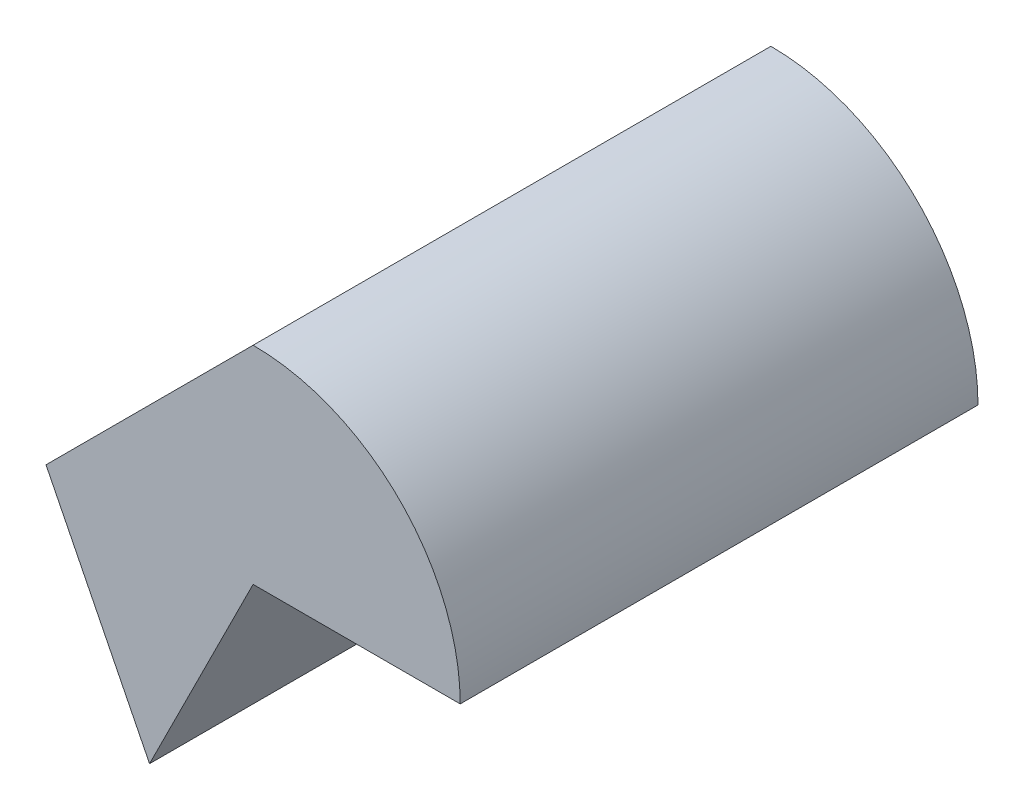
ISO-10303-21;
HEADER;
FILE_DESCRIPTION(('STEP AP214'),'2;1');
FILE_NAME('part.step','',(''),(''),'','','');
FILE_SCHEMA(('AUTOMOTIVE_DESIGN { 1 0 10303 214 1 1 1 1 }'));
ENDSEC;
DATA;
#1=APPLICATION_CONTEXT('core data for automotive mechanical design processes');
#2=APPLICATION_PROTOCOL_DEFINITION('international standard','automotive_design',2000,#1);
#3=PRODUCT_CONTEXT('',#1,'mechanical');
#4=PRODUCT('Part','Part','',(#3));
#5=PRODUCT_RELATED_PRODUCT_CATEGORY('part','',(#4));
#6=PRODUCT_DEFINITION_FORMATION('','',#4);
#7=PRODUCT_DEFINITION_CONTEXT('part definition',#1,'design');
#8=PRODUCT_DEFINITION('design','',#6,#7);
#9=PRODUCT_DEFINITION_SHAPE('','',#8);
#10=(LENGTH_UNIT() NAMED_UNIT(*) SI_UNIT(.MILLI.,.METRE.));
#11=(NAMED_UNIT(*) PLANE_ANGLE_UNIT() SI_UNIT($,.RADIAN.));
#12=(NAMED_UNIT(*) SI_UNIT($,.STERADIAN.) SOLID_ANGLE_UNIT());
#13=UNCERTAINTY_MEASURE_WITH_UNIT(LENGTH_MEASURE(1.E-05),#10,'distance_accuracy_value','');
#14=(GEOMETRIC_REPRESENTATION_CONTEXT(3) GLOBAL_UNCERTAINTY_ASSIGNED_CONTEXT((#13)) GLOBAL_UNIT_ASSIGNED_CONTEXT((#10,
#11,#12)) REPRESENTATION_CONTEXT('',''));
#15=CARTESIAN_POINT('',(0.,0.,0.));
#16=DIRECTION('',(0.,0.,1.));
#17=DIRECTION('',(1.,0.,0.));
#18=AXIS2_PLACEMENT_3D('',#15,#16,#17);
#19=CARTESIAN_POINT('',(-5.,-10.,25.));
#20=DIRECTION('',(0.894427190999916,0.447213595499958,0.));
#21=DIRECTION('',(-0.447213595499958,0.894427190999916,0.));
#22=AXIS2_PLACEMENT_3D('',#19,#20,#21);
#23=PLANE('',#22);
#24=DIRECTION('',(0.447213595499958,-0.894427190999916,0.));
#25=VECTOR('',#24,1.);
#26=CARTESIAN_POINT('',(-5.,-10.,0.));
#27=LINE('',#26,#25);
#28=CARTESIAN_POINT('',(-10.,0.,0.));
#29=VERTEX_POINT('',#28);
#30=CARTESIAN_POINT('',(-5.,-10.,0.));
#31=VERTEX_POINT('',#30);
#32=EDGE_CURVE('E107',#29,#31,#27,.T.);
#33=ORIENTED_EDGE('',*,*,#32,.T.);
#34=DIRECTION('',(0.,0.,-1.));
#35=VECTOR('',#34,1.);
#36=CARTESIAN_POINT('',(-5.,-10.,25.));
#37=LINE('',#36,#35);
#38=CARTESIAN_POINT('',(-5.,-10.,25.));
#39=VERTEX_POINT('',#38);
#40=EDGE_CURVE('E11',#39,#31,#37,.T.);
#41=ORIENTED_EDGE('',*,*,#40,.F.);
#42=DIRECTION('',(0.447213595499958,-0.894427190999916,0.));
#43=VECTOR('',#42,1.);
#44=CARTESIAN_POINT('',(-5.,-10.,25.));
#45=LINE('',#44,#43);
#46=CARTESIAN_POINT('',(-10.,0.,25.));
#47=VERTEX_POINT('',#46);
#48=EDGE_CURVE('E115',#47,#39,#45,.T.);
#49=ORIENTED_EDGE('',*,*,#48,.F.);
#50=DIRECTION('',(0.,0.,-1.));
#51=VECTOR('',#50,1.);
#52=CARTESIAN_POINT('',(-10.,0.,25.));
#53=LINE('',#52,#51);
#54=EDGE_CURVE('E103',#47,#29,#53,.T.);
#55=ORIENTED_EDGE('',*,*,#54,.T.);
#56=EDGE_LOOP('',(#33,#41,#49,#55));
#57=FACE_BOUND('',#56,.T.);
#58=ADVANCED_FACE('F33',(#57),#23,.F.);
#59=CARTESIAN_POINT('',(0.,0.,25.));
#60=DIRECTION('',(-0.894427190999916,0.447213595499958,0.));
#61=DIRECTION('',(-0.447213595499958,-0.894427190999916,0.));
#62=AXIS2_PLACEMENT_3D('',#59,#60,#61);
#63=PLANE('',#62);
#64=DIRECTION('',(0.447213595499958,0.894427190999916,0.));
#65=VECTOR('',#64,1.);
#66=CARTESIAN_POINT('',(0.,0.,0.));
#67=LINE('',#66,#65);
#68=CARTESIAN_POINT('',(0.,0.,0.));
#69=VERTEX_POINT('',#68);
#70=EDGE_CURVE('E110',#31,#69,#67,.T.);
#71=ORIENTED_EDGE('',*,*,#70,.T.);
#72=DIRECTION('',(0.,0.,-1.));
#73=VECTOR('',#72,1.);
#74=CARTESIAN_POINT('',(0.,0.,25.));
#75=LINE('',#74,#73);
#76=CARTESIAN_POINT('',(0.,0.,25.));
#77=VERTEX_POINT('',#76);
#78=EDGE_CURVE('E41',#77,#69,#75,.T.);
#79=ORIENTED_EDGE('',*,*,#78,.F.);
#80=DIRECTION('',(0.447213595499958,0.894427190999916,0.));
#81=VECTOR('',#80,1.);
#82=CARTESIAN_POINT('',(0.,0.,25.));
#83=LINE('',#82,#81);
#84=EDGE_CURVE('E83',#39,#77,#83,.T.);
#85=ORIENTED_EDGE('',*,*,#84,.F.);
#86=ORIENTED_EDGE('',*,*,#40,.T.);
#87=EDGE_LOOP('',(#71,#79,#85,#86));
#88=FACE_BOUND('',#87,.T.);
#89=ADVANCED_FACE('F134',(#88),#63,.F.);
#90=CARTESIAN_POINT('',(0.,0.,25.));
#91=DIRECTION('',(0.,1.,0.));
#92=DIRECTION('',(0.,0.,1.));
#93=AXIS2_PLACEMENT_3D('',#90,#91,#92);
#94=PLANE('',#93);
#95=DIRECTION('',(1.,0.,0.));
#96=VECTOR('',#95,1.);
#97=CARTESIAN_POINT('',(0.,0.,0.));
#98=LINE('',#97,#96);
#99=CARTESIAN_POINT('',(10.,0.,0.));
#100=VERTEX_POINT('',#99);
#101=EDGE_CURVE('E98',#69,#100,#98,.T.);
#102=ORIENTED_EDGE('',*,*,#101,.T.);
#103=DIRECTION('',(0.,0.,-1.));
#104=VECTOR('',#103,1.);
#105=CARTESIAN_POINT('',(10.,0.,25.));
#106=LINE('',#105,#104);
#107=CARTESIAN_POINT('',(10.,0.,25.));
#108=VERTEX_POINT('',#107);
#109=EDGE_CURVE('E95',#108,#100,#106,.T.);
#110=ORIENTED_EDGE('',*,*,#109,.F.);
#111=DIRECTION('',(1.,0.,0.));
#112=VECTOR('',#111,1.);
#113=CARTESIAN_POINT('',(0.,0.,25.));
#114=LINE('',#113,#112);
#115=EDGE_CURVE('E87',#77,#108,#114,.T.);
#116=ORIENTED_EDGE('',*,*,#115,.F.);
#117=ORIENTED_EDGE('',*,*,#78,.T.);
#118=EDGE_LOOP('',(#102,#110,#116,#117));
#119=FACE_BOUND('',#118,.T.);
#120=ADVANCED_FACE('F96',(#119),#94,.F.);
#121=CARTESIAN_POINT('',(0.,0.,25.));
#122=DIRECTION('',(0.,0.,-1.));
#123=DIRECTION('',(-1.,0.,0.));
#124=AXIS2_PLACEMENT_3D('',#121,#122,#123);
#125=CYLINDRICAL_SURFACE('',#124,10.);
#126=CARTESIAN_POINT('',(0.,0.,0.));
#127=DIRECTION('',(0.,0.,1.));
#128=DIRECTION('',(-1.,0.,0.));
#129=AXIS2_PLACEMENT_3D('',#126,#127,#128);
#130=CIRCLE('',#129,10.);
#131=CARTESIAN_POINT('',(0.,10.,0.));
#132=VERTEX_POINT('',#131);
#133=EDGE_CURVE('E69',#100,#132,#130,.T.);
#134=ORIENTED_EDGE('',*,*,#133,.T.);
#135=DIRECTION('',(0.,0.,-1.));
#136=VECTOR('',#135,1.);
#137=CARTESIAN_POINT('',(0.,10.,25.));
#138=LINE('',#137,#136);
#139=CARTESIAN_POINT('',(0.,10.,25.));
#140=VERTEX_POINT('',#139);
#141=EDGE_CURVE('E99',#140,#132,#138,.T.);
#142=ORIENTED_EDGE('',*,*,#141,.F.);
#143=CARTESIAN_POINT('',(0.,0.,25.));
#144=DIRECTION('',(0.,0.,1.));
#145=DIRECTION('',(-1.,0.,0.));
#146=AXIS2_PLACEMENT_3D('',#143,#144,#145);
#147=CIRCLE('',#146,10.);
#148=EDGE_CURVE('E91',#108,#140,#147,.T.);
#149=ORIENTED_EDGE('',*,*,#148,.F.);
#150=ORIENTED_EDGE('',*,*,#109,.T.);
#151=EDGE_LOOP('',(#134,#142,#149,#150));
#152=FACE_BOUND('',#151,.T.);
#153=ADVANCED_FACE('F101',(#152),#125,.T.);
#154=CARTESIAN_POINT('',(-10.,0.,25.));
#155=DIRECTION('',(0.707106781186547,-0.707106781186548,0.));
#156=DIRECTION('',(0.707106781186548,0.707106781186547,0.));
#157=AXIS2_PLACEMENT_3D('',#154,#155,#156);
#158=PLANE('',#157);
#159=DIRECTION('',(-0.707106781186548,-0.707106781186547,0.));
#160=VECTOR('',#159,1.);
#161=CARTESIAN_POINT('',(-10.,0.,0.));
#162=LINE('',#161,#160);
#163=EDGE_CURVE('E75',#132,#29,#162,.T.);
#164=ORIENTED_EDGE('',*,*,#163,.T.);
#165=ORIENTED_EDGE('',*,*,#54,.F.);
#166=DIRECTION('',(-0.707106781186548,-0.707106781186547,0.));
#167=VECTOR('',#166,1.);
#168=CARTESIAN_POINT('',(-10.,0.,25.));
#169=LINE('',#168,#167);
#170=EDGE_CURVE('E49',#140,#47,#169,.T.);
#171=ORIENTED_EDGE('',*,*,#170,.F.);
#172=ORIENTED_EDGE('',*,*,#141,.T.);
#173=EDGE_LOOP('',(#164,#165,#171,#172));
#174=FACE_BOUND('',#173,.T.);
#175=ADVANCED_FACE('F123',(#174),#158,.F.);
#176=CARTESIAN_POINT('',(0.,0.,25.));
#177=DIRECTION('',(0.,0.,-1.));
#178=DIRECTION('',(-1.,0.,0.));
#179=AXIS2_PLACEMENT_3D('',#176,#177,#178);
#180=PLANE('',#179);
#181=ORIENTED_EDGE('',*,*,#48,.T.);
#182=ORIENTED_EDGE('',*,*,#84,.T.);
#183=ORIENTED_EDGE('',*,*,#115,.T.);
#184=ORIENTED_EDGE('',*,*,#148,.T.);
#185=ORIENTED_EDGE('',*,*,#170,.T.);
#186=EDGE_LOOP('',(#181,#182,#183,#184,#185));
#187=FACE_BOUND('',#186,.T.);
#188=ADVANCED_FACE('F89',(#187),#180,.F.);
#189=CARTESIAN_POINT('',(0.,0.,0.));
#190=DIRECTION('',(0.,0.,-1.));
#191=DIRECTION('',(-1.,0.,0.));
#192=AXIS2_PLACEMENT_3D('',#189,#190,#191);
#193=PLANE('',#192);
#194=ORIENTED_EDGE('',*,*,#32,.F.);
#195=ORIENTED_EDGE('',*,*,#163,.F.);
#196=ORIENTED_EDGE('',*,*,#133,.F.);
#197=ORIENTED_EDGE('',*,*,#101,.F.);
#198=ORIENTED_EDGE('',*,*,#70,.F.);
#199=EDGE_LOOP('',(#194,#195,#196,#197,#198));
#200=FACE_BOUND('',#199,.T.);
#201=ADVANCED_FACE('F119',(#200),#193,.T.);
#202=CLOSED_SHELL('',(#58,#89,#120,#153,#175,#188,#201));
#203=MANIFOLD_SOLID_BREP('B2',#202);
#204=ADVANCED_BREP_SHAPE_REPRESENTATION('',(#18,#203),#14);
#205=SHAPE_DEFINITION_REPRESENTATION(#9,#204);
ENDSEC;
END-ISO-10303-21;
